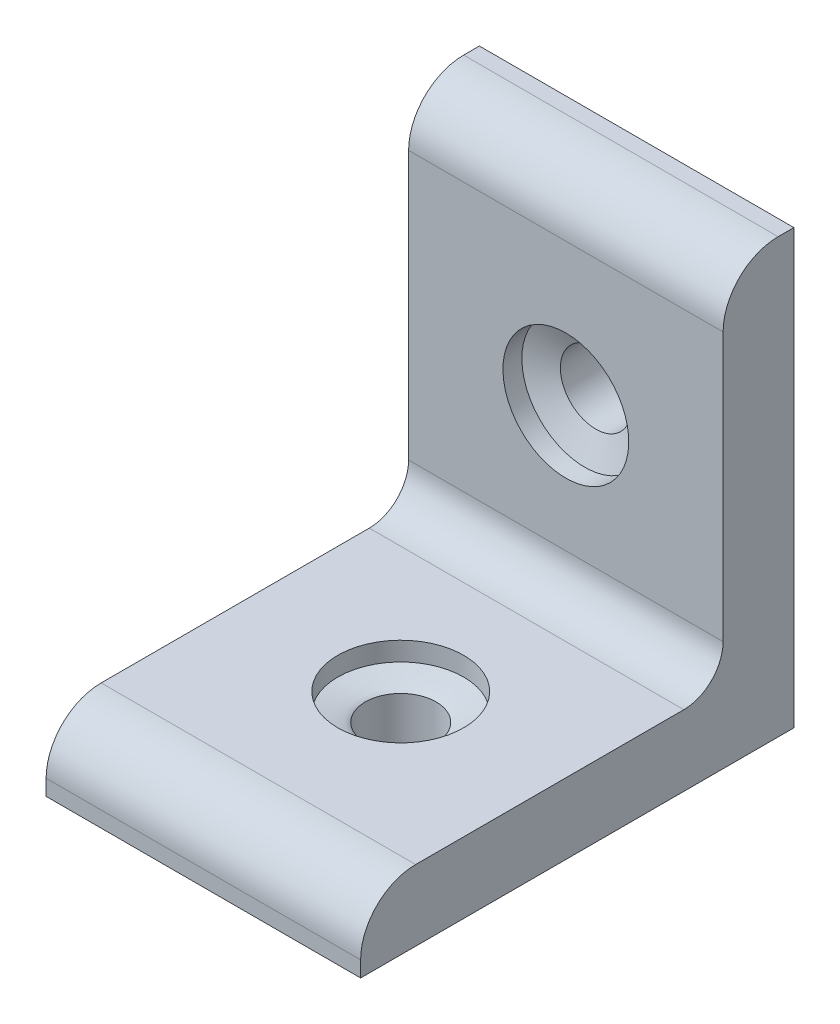
ISO-10303-21;
HEADER;
FILE_DESCRIPTION(('STEP AP214'),'2;1');
FILE_NAME('part.step','',(''),(''),'','','');
FILE_SCHEMA(('AUTOMOTIVE_DESIGN { 1 0 10303 214 1 1 1 1 }'));
ENDSEC;
DATA;
#1=APPLICATION_CONTEXT('core data for automotive mechanical design processes');
#2=APPLICATION_PROTOCOL_DEFINITION('international standard','automotive_design',2000,#1);
#3=PRODUCT_CONTEXT('',#1,'mechanical');
#4=PRODUCT('Part','Part','',(#3));
#5=PRODUCT_RELATED_PRODUCT_CATEGORY('part','',(#4));
#6=PRODUCT_DEFINITION_FORMATION('','',#4);
#7=PRODUCT_DEFINITION_CONTEXT('part definition',#1,'design');
#8=PRODUCT_DEFINITION('design','',#6,#7);
#9=PRODUCT_DEFINITION_SHAPE('','',#8);
#10=(LENGTH_UNIT() NAMED_UNIT(*) SI_UNIT(.MILLI.,.METRE.));
#11=(NAMED_UNIT(*) PLANE_ANGLE_UNIT() SI_UNIT($,.RADIAN.));
#12=(NAMED_UNIT(*) SI_UNIT($,.STERADIAN.) SOLID_ANGLE_UNIT());
#13=UNCERTAINTY_MEASURE_WITH_UNIT(LENGTH_MEASURE(1.E-05),#10,'distance_accuracy_value','');
#14=(GEOMETRIC_REPRESENTATION_CONTEXT(3) GLOBAL_UNCERTAINTY_ASSIGNED_CONTEXT((#13)) GLOBAL_UNIT_ASSIGNED_CONTEXT((#10,
#11,#12)) REPRESENTATION_CONTEXT('',''));
#15=CARTESIAN_POINT('',(0.,0.,0.));
#16=DIRECTION('',(0.,0.,1.));
#17=DIRECTION('',(1.,0.,0.));
#18=AXIS2_PLACEMENT_3D('',#15,#16,#17);
#19=CARTESIAN_POINT('',(20.,30.,55.101));
#20=DIRECTION('',(0.,0.,-1.));
#21=DIRECTION('',(0.,1.,0.));
#22=AXIS2_PLACEMENT_3D('',#19,#20,#21);
#23=CYLINDRICAL_SURFACE('',#22,4.5);
#24=CARTESIAN_POINT('',(20.,30.,5.2));
#25=DIRECTION('',(0.,0.,1.));
#26=DIRECTION('',(0.,-1.,0.));
#27=AXIS2_PLACEMENT_3D('',#24,#25,#26);
#28=CIRCLE('',#27,4.5);
#29=CARTESIAN_POINT('',(20.,25.5,5.2));
#30=VERTEX_POINT('',#29);
#31=EDGE_CURVE('E161',#30,#30,#28,.T.);
#32=ORIENTED_EDGE('',*,*,#31,.T.);
#33=EDGE_LOOP('',(#32));
#34=FACE_BOUND('',#33,.T.);
#35=CARTESIAN_POINT('',(20.,30.,0.));
#36=DIRECTION('',(0.,0.,1.));
#37=DIRECTION('',(0.,-1.,0.));
#38=AXIS2_PLACEMENT_3D('',#35,#36,#37);
#39=CIRCLE('',#38,4.5);
#40=CARTESIAN_POINT('',(20.,25.5,0.));
#41=VERTEX_POINT('',#40);
#42=EDGE_CURVE('E270',#41,#41,#39,.T.);
#43=ORIENTED_EDGE('',*,*,#42,.F.);
#44=EDGE_LOOP('',(#43));
#45=FACE_BOUND('',#44,.T.);
#46=ADVANCED_FACE('F16',(#34,#45),#23,.F.);
#47=CARTESIAN_POINT('',(20.,55.101,30.));
#48=DIRECTION('',(0.,-1.,0.));
#49=DIRECTION('',(0.,0.,-1.));
#50=AXIS2_PLACEMENT_3D('',#47,#48,#49);
#51=CYLINDRICAL_SURFACE('',#50,4.5);
#52=CARTESIAN_POINT('',(20.,0.,30.));
#53=DIRECTION('',(0.,-1.,0.));
#54=DIRECTION('',(0.,0.,-1.));
#55=AXIS2_PLACEMENT_3D('',#52,#53,#54);
#56=CIRCLE('',#55,4.5);
#57=CARTESIAN_POINT('',(20.,0.,25.5));
#58=VERTEX_POINT('',#57);
#59=EDGE_CURVE('E125',#58,#58,#56,.T.);
#60=ORIENTED_EDGE('',*,*,#59,.T.);
#61=EDGE_LOOP('',(#60));
#62=FACE_BOUND('',#61,.T.);
#63=CARTESIAN_POINT('',(20.,5.61288547047282,30.));
#64=DIRECTION('',(0.,1.,0.));
#65=DIRECTION('',(0.,0.,1.));
#66=AXIS2_PLACEMENT_3D('',#63,#64,#65);
#67=CIRCLE('',#66,4.5);
#68=CARTESIAN_POINT('',(19.4613762812828,5.61288547047283,25.5323513466662));
#69=VERTEX_POINT('',#68);
#70=EDGE_CURVE('E264',#69,#69,#67,.T.);
#71=ORIENTED_EDGE('',*,*,#70,.T.);
#72=EDGE_LOOP('',(#71));
#73=FACE_BOUND('',#72,.T.);
#74=ADVANCED_FACE('F177',(#62,#73),#51,.F.);
#75=CARTESIAN_POINT('',(40.,9.,0.));
#76=DIRECTION('',(0.,-1.,0.));
#77=DIRECTION('',(0.,0.,-1.));
#78=AXIS2_PLACEMENT_3D('',#75,#76,#77);
#79=PLANE('',#78);
#80=CARTESIAN_POINT('',(20.,9.,30.));
#81=DIRECTION('',(0.,1.,0.));
#82=DIRECTION('',(0.,0.,1.));
#83=AXIS2_PLACEMENT_3D('',#80,#81,#82);
#84=CIRCLE('',#83,8.);
#85=CARTESIAN_POINT('',(20.,8.99999999999999,38.));
#86=VERTEX_POINT('',#85);
#87=EDGE_CURVE('E261',#86,#86,#84,.T.);
#88=ORIENTED_EDGE('',*,*,#87,.F.);
#89=EDGE_LOOP('',(#88));
#90=FACE_BOUND('',#89,.T.);
#91=DIRECTION('',(0.,0.,1.));
#92=VECTOR('',#91,1.);
#93=CARTESIAN_POINT('',(40.,9.,0.));
#94=LINE('',#93,#92);
#95=CARTESIAN_POINT('',(40.,9.,14.));
#96=VERTEX_POINT('',#95);
#97=CARTESIAN_POINT('',(40.,8.99999999999999,48.1));
#98=VERTEX_POINT('',#97);
#99=EDGE_CURVE('E110',#96,#98,#94,.T.);
#100=ORIENTED_EDGE('',*,*,#99,.F.);
#101=DIRECTION('',(-1.,0.,0.));
#102=VECTOR('',#101,1.);
#103=CARTESIAN_POINT('',(0.,9.,14.));
#104=LINE('',#103,#102);
#105=CARTESIAN_POINT('',(0.,9.,14.));
#106=VERTEX_POINT('',#105);
#107=EDGE_CURVE('E156',#96,#106,#104,.T.);
#108=ORIENTED_EDGE('',*,*,#107,.T.);
#109=DIRECTION('',(0.,0.,1.));
#110=VECTOR('',#109,1.);
#111=CARTESIAN_POINT('',(0.,9.,0.));
#112=LINE('',#111,#110);
#113=CARTESIAN_POINT('',(0.,8.99999999999999,48.1));
#114=VERTEX_POINT('',#113);
#115=EDGE_CURVE('E123',#106,#114,#112,.T.);
#116=ORIENTED_EDGE('',*,*,#115,.T.);
#117=DIRECTION('',(-1.,0.,0.));
#118=VECTOR('',#117,1.);
#119=CARTESIAN_POINT('',(40.,8.99999999999999,48.1));
#120=LINE('',#119,#118);
#121=EDGE_CURVE('E145',#114,#98,#120,.F.);
#122=ORIENTED_EDGE('',*,*,#121,.T.);
#123=EDGE_LOOP('',(#100,#108,#116,#122));
#124=FACE_BOUND('',#123,.T.);
#125=ADVANCED_FACE('F199',(#90,#124),#79,.F.);
#126=CARTESIAN_POINT('',(40.,0.,55.1));
#127=DIRECTION('',(0.,0.,1.));
#128=DIRECTION('',(1.,0.,0.));
#129=AXIS2_PLACEMENT_3D('',#126,#127,#128);
#130=PLANE('',#129);
#131=DIRECTION('',(0.,1.,0.));
#132=VECTOR('',#131,1.);
#133=CARTESIAN_POINT('',(40.,0.,55.1));
#134=LINE('',#133,#132);
#135=CARTESIAN_POINT('',(40.,0.,55.1));
#136=VERTEX_POINT('',#135);
#137=CARTESIAN_POINT('',(40.,1.99999999999999,55.1));
#138=VERTEX_POINT('',#137);
#139=EDGE_CURVE('E91',#136,#138,#134,.T.);
#140=ORIENTED_EDGE('',*,*,#139,.T.);
#141=DIRECTION('',(-1.,0.,0.));
#142=VECTOR('',#141,1.);
#143=CARTESIAN_POINT('',(0.,1.99999999999999,55.1));
#144=LINE('',#143,#142);
#145=CARTESIAN_POINT('',(0.,1.99999999999999,55.1));
#146=VERTEX_POINT('',#145);
#147=EDGE_CURVE('E99',#138,#146,#144,.T.);
#148=ORIENTED_EDGE('',*,*,#147,.T.);
#149=DIRECTION('',(0.,1.,0.));
#150=VECTOR('',#149,1.);
#151=CARTESIAN_POINT('',(0.,0.,55.1));
#152=LINE('',#151,#150);
#153=CARTESIAN_POINT('',(0.,0.,55.1));
#154=VERTEX_POINT('',#153);
#155=EDGE_CURVE('E94',#154,#146,#152,.T.);
#156=ORIENTED_EDGE('',*,*,#155,.F.);
#157=DIRECTION('',(-1.,0.,0.));
#158=VECTOR('',#157,1.);
#159=CARTESIAN_POINT('',(40.,0.,55.1));
#160=LINE('',#159,#158);
#161=EDGE_CURVE('E87',#136,#154,#160,.T.);
#162=ORIENTED_EDGE('',*,*,#161,.F.);
#163=EDGE_LOOP('',(#140,#148,#156,#162));
#164=FACE_BOUND('',#163,.T.);
#165=ADVANCED_FACE('F89',(#164),#130,.T.);
#166=CARTESIAN_POINT('',(40.,0.,0.));
#167=DIRECTION('',(0.,-1.,0.));
#168=DIRECTION('',(0.,0.,-1.));
#169=AXIS2_PLACEMENT_3D('',#166,#167,#168);
#170=PLANE('',#169);
#171=ORIENTED_EDGE('',*,*,#59,.F.);
#172=EDGE_LOOP('',(#171));
#173=FACE_BOUND('',#172,.T.);
#174=DIRECTION('',(0.,0.,1.));
#175=VECTOR('',#174,1.);
#176=CARTESIAN_POINT('',(0.,0.,0.));
#177=LINE('',#176,#175);
#178=CARTESIAN_POINT('',(0.,0.,0.));
#179=VERTEX_POINT('',#178);
#180=EDGE_CURVE('E127',#179,#154,#177,.T.);
#181=ORIENTED_EDGE('',*,*,#180,.F.);
#182=DIRECTION('',(-1.,0.,0.));
#183=VECTOR('',#182,1.);
#184=CARTESIAN_POINT('',(40.,0.,0.));
#185=LINE('',#184,#183);
#186=CARTESIAN_POINT('',(40.,0.,0.));
#187=VERTEX_POINT('',#186);
#188=EDGE_CURVE('E100',#187,#179,#185,.T.);
#189=ORIENTED_EDGE('',*,*,#188,.F.);
#190=DIRECTION('',(0.,0.,1.));
#191=VECTOR('',#190,1.);
#192=CARTESIAN_POINT('',(40.,0.,0.));
#193=LINE('',#192,#191);
#194=EDGE_CURVE('E106',#187,#136,#193,.T.);
#195=ORIENTED_EDGE('',*,*,#194,.T.);
#196=ORIENTED_EDGE('',*,*,#161,.T.);
#197=EDGE_LOOP('',(#181,#189,#195,#196));
#198=FACE_BOUND('',#197,.T.);
#199=ADVANCED_FACE('F112',(#173,#198),#170,.T.);
#200=CARTESIAN_POINT('',(40.,0.,0.));
#201=DIRECTION('',(0.,0.,-1.));
#202=DIRECTION('',(-1.,0.,0.));
#203=AXIS2_PLACEMENT_3D('',#200,#201,#202);
#204=PLANE('',#203);
#205=ORIENTED_EDGE('',*,*,#42,.T.);
#206=EDGE_LOOP('',(#205));
#207=FACE_BOUND('',#206,.T.);
#208=DIRECTION('',(0.,-1.,0.));
#209=VECTOR('',#208,1.);
#210=CARTESIAN_POINT('',(0.,0.,0.));
#211=LINE('',#210,#209);
#212=CARTESIAN_POINT('',(0.,55.1,0.));
#213=VERTEX_POINT('',#212);
#214=EDGE_CURVE('E129',#213,#179,#211,.T.);
#215=ORIENTED_EDGE('',*,*,#214,.F.);
#216=DIRECTION('',(-1.,0.,0.));
#217=VECTOR('',#216,1.);
#218=CARTESIAN_POINT('',(40.,55.1,0.));
#219=LINE('',#218,#217);
#220=CARTESIAN_POINT('',(40.,55.1,0.));
#221=VERTEX_POINT('',#220);
#222=EDGE_CURVE('E122',#221,#213,#219,.T.);
#223=ORIENTED_EDGE('',*,*,#222,.F.);
#224=DIRECTION('',(0.,-1.,0.));
#225=VECTOR('',#224,1.);
#226=CARTESIAN_POINT('',(40.,0.,0.));
#227=LINE('',#226,#225);
#228=EDGE_CURVE('E113',#221,#187,#227,.T.);
#229=ORIENTED_EDGE('',*,*,#228,.T.);
#230=ORIENTED_EDGE('',*,*,#188,.T.);
#231=EDGE_LOOP('',(#215,#223,#229,#230));
#232=FACE_BOUND('',#231,.T.);
#233=ADVANCED_FACE('F214',(#207,#232),#204,.T.);
#234=CARTESIAN_POINT('',(40.,55.1,9.));
#235=DIRECTION('',(0.,1.,0.));
#236=DIRECTION('',(0.,0.,1.));
#237=AXIS2_PLACEMENT_3D('',#234,#235,#236);
#238=PLANE('',#237);
#239=DIRECTION('',(0.,0.,-1.));
#240=VECTOR('',#239,1.);
#241=CARTESIAN_POINT('',(0.,55.1,9.));
#242=LINE('',#241,#240);
#243=CARTESIAN_POINT('',(0.,55.1,2.));
#244=VERTEX_POINT('',#243);
#245=EDGE_CURVE('E132',#244,#213,#242,.T.);
#246=ORIENTED_EDGE('',*,*,#245,.F.);
#247=DIRECTION('',(-1.,0.,0.));
#248=VECTOR('',#247,1.);
#249=CARTESIAN_POINT('',(40.,55.1,2.));
#250=LINE('',#249,#248);
#251=CARTESIAN_POINT('',(40.,55.1,2.));
#252=VERTEX_POINT('',#251);
#253=EDGE_CURVE('E154',#244,#252,#250,.F.);
#254=ORIENTED_EDGE('',*,*,#253,.T.);
#255=DIRECTION('',(0.,0.,-1.));
#256=VECTOR('',#255,1.);
#257=CARTESIAN_POINT('',(40.,55.1,9.));
#258=LINE('',#257,#256);
#259=EDGE_CURVE('E115',#252,#221,#258,.T.);
#260=ORIENTED_EDGE('',*,*,#259,.T.);
#261=ORIENTED_EDGE('',*,*,#222,.T.);
#262=EDGE_LOOP('',(#246,#254,#260,#261));
#263=FACE_BOUND('',#262,.T.);
#264=ADVANCED_FACE('F210',(#263),#238,.T.);
#265=CARTESIAN_POINT('',(40.,0.,9.));
#266=DIRECTION('',(0.,0.,-1.));
#267=DIRECTION('',(-1.,0.,0.));
#268=AXIS2_PLACEMENT_3D('',#265,#266,#267);
#269=PLANE('',#268);
#270=CARTESIAN_POINT('',(20.,30.,9.));
#271=DIRECTION('',(0.,0.,-1.));
#272=DIRECTION('',(0.,1.,0.));
#273=AXIS2_PLACEMENT_3D('',#270,#271,#272);
#274=CIRCLE('',#273,8.);
#275=CARTESIAN_POINT('',(20.,38.,9.));
#276=VERTEX_POINT('',#275);
#277=EDGE_CURVE('E273',#276,#276,#274,.T.);
#278=ORIENTED_EDGE('',*,*,#277,.T.);
#279=EDGE_LOOP('',(#278));
#280=FACE_BOUND('',#279,.T.);
#281=DIRECTION('',(0.,1.,0.));
#282=VECTOR('',#281,1.);
#283=CARTESIAN_POINT('',(0.,0.,9.));
#284=LINE('',#283,#282);
#285=CARTESIAN_POINT('',(0.,48.1,9.));
#286=VERTEX_POINT('',#285);
#287=CARTESIAN_POINT('',(0.,14.,9.));
#288=VERTEX_POINT('',#287);
#289=EDGE_CURVE('E134',#286,#288,#284,.F.);
#290=ORIENTED_EDGE('',*,*,#289,.T.);
#291=DIRECTION('',(-1.,0.,0.));
#292=VECTOR('',#291,1.);
#293=CARTESIAN_POINT('',(40.,14.,9.));
#294=LINE('',#293,#292);
#295=CARTESIAN_POINT('',(40.,14.,9.));
#296=VERTEX_POINT('',#295);
#297=EDGE_CURVE('E37',#288,#296,#294,.F.);
#298=ORIENTED_EDGE('',*,*,#297,.T.);
#299=DIRECTION('',(0.,1.,0.));
#300=VECTOR('',#299,1.);
#301=CARTESIAN_POINT('',(40.,0.,9.));
#302=LINE('',#301,#300);
#303=CARTESIAN_POINT('',(40.,48.1,9.));
#304=VERTEX_POINT('',#303);
#305=EDGE_CURVE('E120',#304,#296,#302,.F.);
#306=ORIENTED_EDGE('',*,*,#305,.F.);
#307=DIRECTION('',(-1.,0.,0.));
#308=VECTOR('',#307,1.);
#309=CARTESIAN_POINT('',(0.,48.1,9.));
#310=LINE('',#309,#308);
#311=EDGE_CURVE('E151',#304,#286,#310,.T.);
#312=ORIENTED_EDGE('',*,*,#311,.T.);
#313=EDGE_LOOP('',(#290,#298,#306,#312));
#314=FACE_BOUND('',#313,.T.);
#315=ADVANCED_FACE('F204',(#280,#314),#269,.F.);
#316=CARTESIAN_POINT('',(40.,0.,0.));
#317=DIRECTION('',(-1.,0.,0.));
#318=DIRECTION('',(0.,0.,1.));
#319=AXIS2_PLACEMENT_3D('',#316,#317,#318);
#320=PLANE('',#319);
#321=ORIENTED_EDGE('',*,*,#305,.T.);
#322=CARTESIAN_POINT('',(40.,14.,14.));
#323=DIRECTION('',(-1.,0.,0.));
#324=DIRECTION('',(0.,0.,1.));
#325=AXIS2_PLACEMENT_3D('',#322,#323,#324);
#326=CIRCLE('',#325,5.);
#327=EDGE_CURVE('E10',#296,#96,#326,.T.);
#328=ORIENTED_EDGE('',*,*,#327,.T.);
#329=ORIENTED_EDGE('',*,*,#99,.T.);
#330=CARTESIAN_POINT('',(40.,1.99999999999999,48.1));
#331=DIRECTION('',(-1.,0.,0.));
#332=DIRECTION('',(0.,0.,1.));
#333=AXIS2_PLACEMENT_3D('',#330,#331,#332);
#334=CIRCLE('',#333,7.);
#335=EDGE_CURVE('E109',#98,#138,#334,.F.);
#336=ORIENTED_EDGE('',*,*,#335,.T.);
#337=ORIENTED_EDGE('',*,*,#139,.F.);
#338=ORIENTED_EDGE('',*,*,#194,.F.);
#339=ORIENTED_EDGE('',*,*,#228,.F.);
#340=ORIENTED_EDGE('',*,*,#259,.F.);
#341=CARTESIAN_POINT('',(40.,48.1,2.));
#342=DIRECTION('',(-1.,0.,0.));
#343=DIRECTION('',(0.,0.,1.));
#344=AXIS2_PLACEMENT_3D('',#341,#342,#343);
#345=CIRCLE('',#344,7.);
#346=EDGE_CURVE('E148',#252,#304,#345,.F.);
#347=ORIENTED_EDGE('',*,*,#346,.T.);
#348=EDGE_LOOP('',(#321,#328,#329,#336,#337,#338,#339,#340,#347));
#349=FACE_BOUND('',#348,.T.);
#350=ADVANCED_FACE('F104',(#349),#320,.F.);
#351=CARTESIAN_POINT('',(0.,0.,0.));
#352=DIRECTION('',(-1.,0.,0.));
#353=DIRECTION('',(0.,0.,1.));
#354=AXIS2_PLACEMENT_3D('',#351,#352,#353);
#355=PLANE('',#354);
#356=ORIENTED_EDGE('',*,*,#155,.T.);
#357=CARTESIAN_POINT('',(0.,1.99999999999999,48.1));
#358=DIRECTION('',(-1.,0.,0.));
#359=DIRECTION('',(0.,0.,1.));
#360=AXIS2_PLACEMENT_3D('',#357,#358,#359);
#361=CIRCLE('',#360,7.);
#362=EDGE_CURVE('E142',#146,#114,#361,.T.);
#363=ORIENTED_EDGE('',*,*,#362,.T.);
#364=ORIENTED_EDGE('',*,*,#115,.F.);
#365=CARTESIAN_POINT('',(0.,14.,14.));
#366=DIRECTION('',(-1.,0.,0.));
#367=DIRECTION('',(0.,0.,1.));
#368=AXIS2_PLACEMENT_3D('',#365,#366,#367);
#369=CIRCLE('',#368,5.);
#370=EDGE_CURVE('E24',#106,#288,#369,.F.);
#371=ORIENTED_EDGE('',*,*,#370,.T.);
#372=ORIENTED_EDGE('',*,*,#289,.F.);
#373=CARTESIAN_POINT('',(0.,48.1,2.));
#374=DIRECTION('',(-1.,0.,0.));
#375=DIRECTION('',(0.,0.,1.));
#376=AXIS2_PLACEMENT_3D('',#373,#374,#375);
#377=CIRCLE('',#376,7.);
#378=EDGE_CURVE('E140',#286,#244,#377,.T.);
#379=ORIENTED_EDGE('',*,*,#378,.T.);
#380=ORIENTED_EDGE('',*,*,#245,.T.);
#381=ORIENTED_EDGE('',*,*,#214,.T.);
#382=ORIENTED_EDGE('',*,*,#180,.T.);
#383=EDGE_LOOP('',(#356,#363,#364,#371,#372,#379,#380,#381,#382));
#384=FACE_BOUND('',#383,.T.);
#385=ADVANCED_FACE('F203',(#384),#355,.T.);
#386=CARTESIAN_POINT('',(40.,1.99999999999999,48.1));
#387=DIRECTION('',(1.,0.,0.));
#388=DIRECTION('',(0.,0.,-1.));
#389=AXIS2_PLACEMENT_3D('',#386,#387,#388);
#390=CYLINDRICAL_SURFACE('',#389,7.);
#391=ORIENTED_EDGE('',*,*,#335,.F.);
#392=ORIENTED_EDGE('',*,*,#121,.F.);
#393=ORIENTED_EDGE('',*,*,#362,.F.);
#394=ORIENTED_EDGE('',*,*,#147,.F.);
#395=EDGE_LOOP('',(#391,#392,#393,#394));
#396=FACE_BOUND('',#395,.T.);
#397=ADVANCED_FACE('F207',(#396),#390,.T.);
#398=CARTESIAN_POINT('',(40.,48.1,2.));
#399=DIRECTION('',(1.,0.,0.));
#400=DIRECTION('',(0.,0.,-1.));
#401=AXIS2_PLACEMENT_3D('',#398,#399,#400);
#402=CYLINDRICAL_SURFACE('',#401,7.);
#403=ORIENTED_EDGE('',*,*,#346,.F.);
#404=ORIENTED_EDGE('',*,*,#253,.F.);
#405=ORIENTED_EDGE('',*,*,#378,.F.);
#406=ORIENTED_EDGE('',*,*,#311,.F.);
#407=EDGE_LOOP('',(#403,#404,#405,#406));
#408=FACE_BOUND('',#407,.T.);
#409=ADVANCED_FACE('F195',(#408),#402,.T.);
#410=CARTESIAN_POINT('',(20.,6.6,30.));
#411=DIRECTION('',(0.,1.,0.));
#412=DIRECTION('',(0.,0.,1.));
#413=AXIS2_PLACEMENT_3D('',#410,#411,#412);
#414=CYLINDRICAL_SURFACE('',#413,8.);
#415=CARTESIAN_POINT('',(20.,6.6,30.));
#416=DIRECTION('',(0.,1.,0.));
#417=DIRECTION('',(0.,0.,1.));
#418=AXIS2_PLACEMENT_3D('',#415,#416,#417);
#419=CIRCLE('',#418,8.00000000000001);
#420=CARTESIAN_POINT('',(24.6170241192876,6.6,23.4667704554396));
#421=VERTEX_POINT('',#420);
#422=EDGE_CURVE('E267',#421,#421,#419,.T.);
#423=ORIENTED_EDGE('',*,*,#422,.F.);
#424=EDGE_LOOP('',(#423));
#425=FACE_BOUND('',#424,.T.);
#426=ORIENTED_EDGE('',*,*,#87,.T.);
#427=EDGE_LOOP('',(#426));
#428=FACE_BOUND('',#427,.T.);
#429=ADVANCED_FACE('F186',(#425,#428),#414,.F.);
#430=CARTESIAN_POINT('',(17.3048969473128,5.2,26.3963324882286));
#431=CARTESIAN_POINT('',(24.6170241192876,6.6,23.4667704554396));
#432=CARTESIAN_POINT('',(10.0975619237701,5.2,31.786538593603));
#433=CARTESIAN_POINT('',(11.5505650301669,6.6,14.2327222168644));
#434=CARTESIAN_POINT('',(15.4877680291444,5.19999999999999,38.9938736171457));
#435=CARTESIAN_POINT('',(2.31651679159165,6.6,27.2991813059851));
#436=CARTESIAN_POINT('',(22.6951030526872,5.2,33.6036675117713));
#437=CARTESIAN_POINT('',(15.3829758807124,6.6,36.5332295445604));
#438=CARTESIAN_POINT('',(29.9024380762299,5.2,28.213461406397));
#439=CARTESIAN_POINT('',(28.4494349698331,6.59999999999999,45.7672777831356));
#440=CARTESIAN_POINT('',(24.5122319708555,5.2,21.0061263828543));
#441=CARTESIAN_POINT('',(37.6834832084083,6.6,32.7008186940149));
#442=CARTESIAN_POINT('',(17.3048969473128,5.2,26.3963324882286));
#443=CARTESIAN_POINT('',(24.6170241192876,6.6,23.4667704554396));
#444=(BOUNDED_SURFACE() B_SPLINE_SURFACE(3,1,((#430,#431),(#432,#433),(#434,#435),(#436,#437),
(#438,#439),(#440,#441),(#442,#443)),.UNSPECIFIED.,.T.,.F.,.F.) B_SPLINE_SURFACE_WITH_KNOTS((4,
3,4),(2,2),(0.,0.5,1.),(0.,1.),
.UNSPECIFIED.) GEOMETRIC_REPRESENTATION_ITEM() RATIONAL_B_SPLINE_SURFACE(((1.,1.),
(0.333333333333333,0.333333333333333),(0.333333333333333,0.333333333333333),(1.,1.),
(0.333333333333333,0.333333333333333),(0.333333333333333,0.333333333333333),(1.,1.))) REPRESENTATION_ITEM('') SURFACE());
#445=CARTESIAN_POINT('',(24.6170241192876,6.6,23.4667704554396));
#446=CARTESIAN_POINT('',(24.5633194543084,6.58971755698409,23.4882869230566));
#447=CARTESIAN_POINT('',(24.5096147893292,6.57943511396818,23.5098033906735));
#448=CARTESIAN_POINT('',(24.4022054593708,6.55887022793637,23.5528363259074));
#449=CARTESIAN_POINT('',(24.3485007943915,6.54858778492046,23.5743527935244));
#450=CARTESIAN_POINT('',(24.2410914644331,6.52802289888864,23.6173857287582));
#451=CARTESIAN_POINT('',(24.1873867994539,6.51774045587273,23.6389021963752));
#452=CARTESIAN_POINT('',(24.0799774694955,6.49717556984092,23.6819351316091));
#453=CARTESIAN_POINT('',(24.0262728045162,6.48689312682501,23.703451599226));
#454=CARTESIAN_POINT('',(23.9188634745578,6.46632824079319,23.7464845344599));
#455=CARTESIAN_POINT('',(23.8651588095786,6.45604579777728,23.7680010020768));
#456=CARTESIAN_POINT('',(23.7577494796202,6.43548091174547,23.8110339373107));
#457=CARTESIAN_POINT('',(23.7040448146409,6.42519846872956,23.8325504049277));
#458=CARTESIAN_POINT('',(23.5966354846825,6.40463358269774,23.8755833401616));
#459=CARTESIAN_POINT('',(23.5429308197033,6.39435113968184,23.8970998077785));
#460=CARTESIAN_POINT('',(23.4355214897449,6.37378625365002,23.9401327430124));
#461=CARTESIAN_POINT('',(23.3818168247656,6.36350381063411,23.9616492106293));
#462=CARTESIAN_POINT('',(23.2744074948072,6.3429389246023,24.0046821458632));
#463=CARTESIAN_POINT('',(23.220702829828,6.33265648158639,24.0261986134802));
#464=CARTESIAN_POINT('',(23.1132934998696,6.31209159555457,24.0692315487141));
#465=CARTESIAN_POINT('',(23.0595888348903,6.30180915253866,24.090748016331));
#466=CARTESIAN_POINT('',(22.9521795049319,6.28124426650685,24.1337809515649));
#467=CARTESIAN_POINT('',(22.8984748399527,6.27096182349094,24.1552974191818));
#468=CARTESIAN_POINT('',(22.7910655099943,6.25039693745912,24.1983303544157));
#469=CARTESIAN_POINT('',(22.737360845015,6.24011449444322,24.2198468220327));
#470=CARTESIAN_POINT('',(22.6299515150566,6.2195496084114,24.2628797572665));
#471=CARTESIAN_POINT('',(22.5762468500774,6.20926716539549,24.2843962248835));
#472=CARTESIAN_POINT('',(22.468837520119,6.18870227936368,24.3274291601174));
#473=CARTESIAN_POINT('',(22.4151328551397,6.17841983634777,24.3489456277343));
#474=CARTESIAN_POINT('',(22.3077235251813,6.15785495031595,24.3919785629682));
#475=CARTESIAN_POINT('',(22.2540188602021,6.14757250730004,24.4134950305851));
#476=CARTESIAN_POINT('',(22.1466095302437,6.12700762126823,24.456527965819));
#477=CARTESIAN_POINT('',(22.0929048652644,6.11672517825232,24.478044433436));
#478=CARTESIAN_POINT('',(21.985495535306,6.0961602922205,24.5210773686699));
#479=CARTESIAN_POINT('',(21.9317908703268,6.0858778492046,24.5425938362868));
#480=CARTESIAN_POINT('',(21.8243815403683,6.06531296317278,24.5856267715207));
#481=CARTESIAN_POINT('',(21.7706768753891,6.05503052015687,24.6071432391376));
#482=CARTESIAN_POINT('',(21.6632675454307,6.03446563412505,24.6501761743715));
#483=CARTESIAN_POINT('',(21.6095628804515,6.02418319110915,24.6716926419885));
#484=CARTESIAN_POINT('',(21.502153550493,6.00361830507733,24.7147255772223));
#485=CARTESIAN_POINT('',(21.4484488855138,5.99333586206142,24.7362420448393));
#486=CARTESIAN_POINT('',(21.3410395555554,5.97277097602961,24.7792749800732));
#487=CARTESIAN_POINT('',(21.2873348905762,5.9624885330137,24.8007914476901));
#488=CARTESIAN_POINT('',(21.1799255606178,5.94192364698188,24.843824382924));
#489=CARTESIAN_POINT('',(21.1262208956385,5.93164120396597,24.8653408505409));
#490=CARTESIAN_POINT('',(21.0188115656801,5.91107631793416,24.9083737857748));
#491=CARTESIAN_POINT('',(20.9651069007009,5.90079387491825,24.9298902533918));
#492=CARTESIAN_POINT('',(20.8576975707424,5.88022898888643,24.9729231886257));
#493=CARTESIAN_POINT('',(20.8039929057632,5.86994654587053,24.9944396562426));
#494=CARTESIAN_POINT('',(20.6965835758048,5.84938165983871,25.0374725914765));
#495=CARTESIAN_POINT('',(20.6428789108256,5.8390992168228,25.0589890590934));
#496=CARTESIAN_POINT('',(20.5354695808671,5.81853433079099,25.1020219943273));
#497=CARTESIAN_POINT('',(20.4817649158879,5.80825188777508,25.1235384619443));
#498=CARTESIAN_POINT('',(20.3743555859295,5.78768700174326,25.1665713971782));
#499=CARTESIAN_POINT('',(20.3206509209503,5.77740455872735,25.1880878647951));
#500=CARTESIAN_POINT('',(20.2132415909918,5.75683967269554,25.231120800029));
#501=CARTESIAN_POINT('',(20.1595369260126,5.74655722967963,25.2526372676459));
#502=CARTESIAN_POINT('',(20.0521275960542,5.72599234364781,25.2956702028798));
#503=CARTESIAN_POINT('',(19.998422931075,5.71570990063191,25.3171866704968));
#504=CARTESIAN_POINT('',(19.8910136011165,5.69514501460009,25.3602196057306));
#505=CARTESIAN_POINT('',(19.8373089361373,5.68486257158418,25.3817360733476));
#506=CARTESIAN_POINT('',(19.7298996061789,5.66429768555236,25.4247690085815));
#507=CARTESIAN_POINT('',(19.6761949411997,5.65401524253646,25.4462854761984));
#508=CARTESIAN_POINT('',(19.5687856112412,5.63345035650464,25.4893184114323));
#509=CARTESIAN_POINT('',(19.515080946262,5.62316791348873,25.5108348790493));
#510=CARTESIAN_POINT('',(19.4613762812828,5.61288547047283,25.5323513466662));
#511=B_SPLINE_CURVE_WITH_KNOTS('',3,(#445,#446,#447,#448,#449,#450,#451,#452,#453,#454,#455,
#456,#457,#458,#459,#460,#461,#462,#463,#464,#465,#466,#467,#468,#469,#470,#471,#472,#473,#474,
#475,#476,#477,#478,#479,#480,#481,#482,#483,#484,#485,#486,#487,#488,#489,#490,#491,#492,#493,
#494,#495,#496,#497,#498,#499,#500,#501,#502,#503,#504,#505,#506,#507,#508,#509,#510),
.UNSPECIFIED.,.F.,.F.,(4,2,2,2,2,2,2,2,2,2,2,2,2,2,2,2,2,2,2,2,2,2,2,2,2,2,2,2,2,2,2,2,4),(0.,
0.176283585403028,0.352567170806055,0.528850756209083,0.705134341612112,0.881417927015138,
1.05770151241817,1.2339850978212,1.41026868322422,1.58655226862725,1.76283585403028,
1.93911943943331,2.11540302483634,2.29168661023937,2.46797019564239,2.64425378104542,
2.82053736644845,2.99682095185148,3.1731045372545,3.34938812265753,3.52567170806056,
3.70195529346359,3.87823887886662,4.05452246426964,4.23080604967267,4.4070896350757,
4.58337322047873,4.75965680588176,4.93594039128478,5.11222397668781,5.28850756209084,
5.46479114749387,5.64107473289689),.UNSPECIFIED.);
#512=EDGE_CURVE('',#421,#69,#511,.T.);
#513=ORIENTED_EDGE('',*,*,#422,.T.);
#514=ORIENTED_EDGE('',*,*,#70,.F.);
#515=ORIENTED_EDGE('',*,*,#512,.T.);
#516=ORIENTED_EDGE('',*,*,#512,.F.);
#517=EDGE_LOOP('',(#513,#515,#514,#516));
#518=FACE_BOUND('',#517,.T.);
#519=ADVANCED_FACE('F181',(#518),#444,.F.);
#520=CARTESIAN_POINT('',(20.,30.,6.6));
#521=DIRECTION('',(0.,0.,1.));
#522=DIRECTION('',(0.,-1.,0.));
#523=AXIS2_PLACEMENT_3D('',#520,#521,#522);
#524=CYLINDRICAL_SURFACE('',#523,8.);
#525=CARTESIAN_POINT('',(20.,30.,6.6));
#526=DIRECTION('',(0.,0.,-1.));
#527=DIRECTION('',(0.,1.,0.));
#528=AXIS2_PLACEMENT_3D('',#525,#526,#527);
#529=CIRCLE('',#528,8.);
#530=CARTESIAN_POINT('',(20.,38.,6.6));
#531=VERTEX_POINT('',#530);
#532=EDGE_CURVE('E276',#531,#531,#529,.T.);
#533=ORIENTED_EDGE('',*,*,#532,.T.);
#534=EDGE_LOOP('',(#533));
#535=FACE_BOUND('',#534,.T.);
#536=ORIENTED_EDGE('',*,*,#277,.F.);
#537=EDGE_LOOP('',(#536));
#538=FACE_BOUND('',#537,.T.);
#539=ADVANCED_FACE('F178',(#535,#538),#524,.F.);
#540=CARTESIAN_POINT('',(20.,30.,5.2));
#541=DIRECTION('',(0.,0.,1.));
#542=DIRECTION('',(0.,1.,0.));
#543=AXIS2_PLACEMENT_3D('',#540,#541,#542);
#544=CONICAL_SURFACE('',#543,4.5,1.19028994968253);
#545=ORIENTED_EDGE('',*,*,#31,.F.);
#546=EDGE_LOOP('',(#545));
#547=FACE_BOUND('',#546,.T.);
#548=ORIENTED_EDGE('',*,*,#532,.F.);
#549=EDGE_LOOP('',(#548));
#550=FACE_BOUND('',#549,.T.);
#551=ADVANCED_FACE('F282',(#547,#550),#544,.F.);
#552=CARTESIAN_POINT('',(40.,14.,14.));
#553=DIRECTION('',(1.,0.,0.));
#554=DIRECTION('',(0.,0.,-1.));
#555=AXIS2_PLACEMENT_3D('',#552,#553,#554);
#556=CYLINDRICAL_SURFACE('',#555,5.);
#557=ORIENTED_EDGE('',*,*,#327,.F.);
#558=ORIENTED_EDGE('',*,*,#297,.F.);
#559=ORIENTED_EDGE('',*,*,#370,.F.);
#560=ORIENTED_EDGE('',*,*,#107,.F.);
#561=EDGE_LOOP('',(#557,#558,#559,#560));
#562=FACE_BOUND('',#561,.T.);
#563=ADVANCED_FACE('F18',(#562),#556,.F.);
#564=CLOSED_SHELL('',(#46,#74,#125,#165,#199,#233,#264,#315,#350,#385,#397,#409,#429,#519,#539,
#551,#563));
#565=MANIFOLD_SOLID_BREP('B1',#564);
#566=ADVANCED_BREP_SHAPE_REPRESENTATION('',(#18,#565),#14);
#567=SHAPE_DEFINITION_REPRESENTATION(#9,#566);
ENDSEC;
END-ISO-10303-21;
